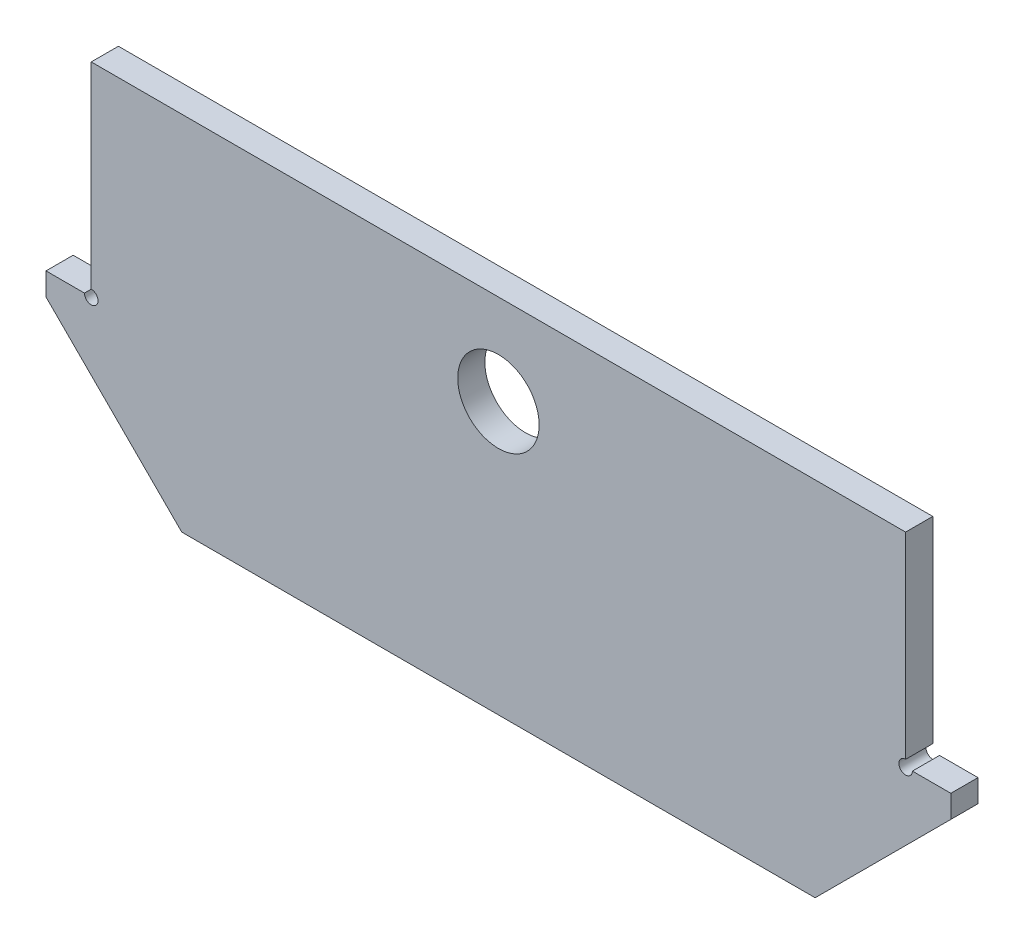
ISO-10303-21;
HEADER;
FILE_DESCRIPTION(('STEP AP214'),'2;1');
FILE_NAME('part.step','',(''),(''),'','','');
FILE_SCHEMA(('AUTOMOTIVE_DESIGN { 1 0 10303 214 1 1 1 1 }'));
ENDSEC;
DATA;
#1=APPLICATION_CONTEXT('core data for automotive mechanical design processes');
#2=APPLICATION_PROTOCOL_DEFINITION('international standard','automotive_design',2000,#1);
#3=PRODUCT_CONTEXT('',#1,'mechanical');
#4=PRODUCT('Part','Part','',(#3));
#5=PRODUCT_RELATED_PRODUCT_CATEGORY('part','',(#4));
#6=PRODUCT_DEFINITION_FORMATION('','',#4);
#7=PRODUCT_DEFINITION_CONTEXT('part definition',#1,'design');
#8=PRODUCT_DEFINITION('design','',#6,#7);
#9=PRODUCT_DEFINITION_SHAPE('','',#8);
#10=(LENGTH_UNIT() NAMED_UNIT(*) SI_UNIT(.MILLI.,.METRE.));
#11=(NAMED_UNIT(*) PLANE_ANGLE_UNIT() SI_UNIT($,.RADIAN.));
#12=(NAMED_UNIT(*) SI_UNIT($,.STERADIAN.) SOLID_ANGLE_UNIT());
#13=UNCERTAINTY_MEASURE_WITH_UNIT(LENGTH_MEASURE(1.E-05),#10,'distance_accuracy_value','');
#14=(GEOMETRIC_REPRESENTATION_CONTEXT(3) GLOBAL_UNCERTAINTY_ASSIGNED_CONTEXT((#13)) GLOBAL_UNIT_ASSIGNED_CONTEXT((#10,
#11,#12)) REPRESENTATION_CONTEXT('',''));
#15=CARTESIAN_POINT('',(0.,0.,0.));
#16=DIRECTION('',(0.,0.,1.));
#17=DIRECTION('',(1.,0.,0.));
#18=AXIS2_PLACEMENT_3D('',#15,#16,#17);
#19=CARTESIAN_POINT('',(0.,0.,-3.));
#20=DIRECTION('',(0.,0.,1.));
#21=DIRECTION('',(1.,0.,0.));
#22=AXIS2_PLACEMENT_3D('',#19,#20,#21);
#23=PLANE('',#22);
#24=DIRECTION('',(1.,0.,0.));
#25=VECTOR('',#24,1.);
#26=CARTESIAN_POINT('',(-99.9999999999998,-1414.,-3.));
#27=LINE('',#26,#25);
#28=CARTESIAN_POINT('',(-91.4999999999998,-1414.,-3.));
#29=VERTEX_POINT('',#28);
#30=CARTESIAN_POINT('',(-99.9999999999998,-1414.,-3.));
#31=VERTEX_POINT('',#30);
#32=EDGE_CURVE('E112',#29,#31,#27,.F.);
#33=ORIENTED_EDGE('',*,*,#32,.F.);
#34=CARTESIAN_POINT('',(-90.,-1414.,-3.));
#35=DIRECTION('',(0.,0.,1.));
#36=DIRECTION('',(1.,0.,0.));
#37=AXIS2_PLACEMENT_3D('',#34,#35,#36);
#38=CIRCLE('',#37,1.49999999999985);
#39=CARTESIAN_POINT('',(-90.,-1412.5,-3.));
#40=VERTEX_POINT('',#39);
#41=EDGE_CURVE('E140',#29,#40,#38,.T.);
#42=ORIENTED_EDGE('',*,*,#41,.T.);
#43=DIRECTION('',(0.,1.,0.));
#44=VECTOR('',#43,1.);
#45=CARTESIAN_POINT('',(-90.,-1414.,-3.));
#46=LINE('',#45,#44);
#47=CARTESIAN_POINT('',(-90.,-1369.,-3.));
#48=VERTEX_POINT('',#47);
#49=EDGE_CURVE('E141',#48,#40,#46,.F.);
#50=ORIENTED_EDGE('',*,*,#49,.F.);
#51=DIRECTION('',(1.,0.,0.));
#52=VECTOR('',#51,1.);
#53=CARTESIAN_POINT('',(-90.,-1369.,-3.));
#54=LINE('',#53,#52);
#55=CARTESIAN_POINT('',(90.0000000000003,-1369.,-3.));
#56=VERTEX_POINT('',#55);
#57=EDGE_CURVE('E145',#56,#48,#54,.F.);
#58=ORIENTED_EDGE('',*,*,#57,.F.);
#59=DIRECTION('',(0.,1.,0.));
#60=VECTOR('',#59,1.);
#61=CARTESIAN_POINT('',(90.0000000000003,-1414.,-3.));
#62=LINE('',#61,#60);
#63=CARTESIAN_POINT('',(90.0000000000003,-1412.5,-3.));
#64=VERTEX_POINT('',#63);
#65=EDGE_CURVE('E157',#64,#56,#62,.T.);
#66=ORIENTED_EDGE('',*,*,#65,.F.);
#67=CARTESIAN_POINT('',(90.0000000000003,-1414.,-3.));
#68=DIRECTION('',(0.,0.,1.));
#69=DIRECTION('',(1.,0.,0.));
#70=AXIS2_PLACEMENT_3D('',#67,#68,#69);
#71=CIRCLE('',#70,1.49999999999985);
#72=CARTESIAN_POINT('',(91.5000000000002,-1414.,-3.));
#73=VERTEX_POINT('',#72);
#74=EDGE_CURVE('E19',#64,#73,#71,.T.);
#75=ORIENTED_EDGE('',*,*,#74,.T.);
#76=DIRECTION('',(1.,0.,0.));
#77=VECTOR('',#76,1.);
#78=CARTESIAN_POINT('',(90.0000000000003,-1414.,-3.));
#79=LINE('',#78,#77);
#80=CARTESIAN_POINT('',(100.,-1414.,-3.));
#81=VERTEX_POINT('',#80);
#82=EDGE_CURVE('E168',#81,#73,#79,.F.);
#83=ORIENTED_EDGE('',*,*,#82,.F.);
#84=DIRECTION('',(0.,1.,0.));
#85=VECTOR('',#84,1.);
#86=CARTESIAN_POINT('',(100.,-1414.,-3.));
#87=LINE('',#86,#85);
#88=CARTESIAN_POINT('',(100.,-1419.,-3.));
#89=VERTEX_POINT('',#88);
#90=EDGE_CURVE('E74',#89,#81,#87,.T.);
#91=ORIENTED_EDGE('',*,*,#90,.F.);
#92=DIRECTION('',(0.707106781186547,0.707106781186548,0.));
#93=VECTOR('',#92,1.);
#94=CARTESIAN_POINT('',(70.0000000000002,-1449.,-3.));
#95=LINE('',#94,#93);
#96=CARTESIAN_POINT('',(70.0000000000002,-1449.,-3.));
#97=VERTEX_POINT('',#96);
#98=EDGE_CURVE('E180',#97,#89,#95,.T.);
#99=ORIENTED_EDGE('',*,*,#98,.F.);
#100=DIRECTION('',(1.,0.,0.));
#101=VECTOR('',#100,1.);
#102=CARTESIAN_POINT('',(-69.9999999999998,-1449.,-3.));
#103=LINE('',#102,#101);
#104=CARTESIAN_POINT('',(-69.9999999999999,-1449.,-3.));
#105=VERTEX_POINT('',#104);
#106=EDGE_CURVE('E191',#105,#97,#103,.T.);
#107=ORIENTED_EDGE('',*,*,#106,.F.);
#108=DIRECTION('',(0.707106781186547,-0.707106781186548,0.));
#109=VECTOR('',#108,1.);
#110=CARTESIAN_POINT('',(-99.9999999999998,-1419.,-3.));
#111=LINE('',#110,#109);
#112=CARTESIAN_POINT('',(-99.9999999999998,-1419.,-3.));
#113=VERTEX_POINT('',#112);
#114=EDGE_CURVE('E201',#113,#105,#111,.T.);
#115=ORIENTED_EDGE('',*,*,#114,.F.);
#116=DIRECTION('',(0.,1.,0.));
#117=VECTOR('',#116,1.);
#118=CARTESIAN_POINT('',(-99.9999999999998,-1414.,-3.));
#119=LINE('',#118,#117);
#120=EDGE_CURVE('E115',#31,#113,#119,.F.);
#121=ORIENTED_EDGE('',*,*,#120,.F.);
#122=EDGE_LOOP('',(#33,#42,#50,#58,#66,#75,#83,#91,#99,#107,#115,#121));
#123=FACE_BOUND('',#122,.T.);
#124=CARTESIAN_POINT('',(7.45777626196619E-13,-1389.,-3.));
#125=DIRECTION('',(0.,0.,1.));
#126=DIRECTION('',(1.,0.,0.));
#127=AXIS2_PLACEMENT_3D('',#124,#125,#126);
#128=CIRCLE('',#127,9.00000000000002);
#129=CARTESIAN_POINT('',(9.00000000000077,-1389.,-3.));
#130=VERTEX_POINT('',#129);
#131=EDGE_CURVE('E130',#130,#130,#128,.T.);
#132=ORIENTED_EDGE('',*,*,#131,.T.);
#133=EDGE_LOOP('',(#132));
#134=FACE_BOUND('',#133,.T.);
#135=ADVANCED_FACE('F16',(#123,#134),#23,.F.);
#136=CARTESIAN_POINT('',(-99.9999999999998,-1414.,-3.));
#137=DIRECTION('',(0.,1.,0.));
#138=DIRECTION('',(0.,0.,1.));
#139=AXIS2_PLACEMENT_3D('',#136,#137,#138);
#140=PLANE('',#139);
#141=DIRECTION('',(0.,0.,1.));
#142=VECTOR('',#141,1.);
#143=CARTESIAN_POINT('',(-99.9999999999998,-1414.,-3.));
#144=LINE('',#143,#142);
#145=CARTESIAN_POINT('',(-99.9999999999998,-1414.,3.));
#146=VERTEX_POINT('',#145);
#147=EDGE_CURVE('E105',#146,#31,#144,.F.);
#148=ORIENTED_EDGE('',*,*,#147,.F.);
#149=DIRECTION('',(1.,0.,0.));
#150=VECTOR('',#149,1.);
#151=CARTESIAN_POINT('',(0.,-1414.,3.));
#152=LINE('',#151,#150);
#153=CARTESIAN_POINT('',(-91.4999999999998,-1414.,3.));
#154=VERTEX_POINT('',#153);
#155=EDGE_CURVE('E110',#154,#146,#152,.F.);
#156=ORIENTED_EDGE('',*,*,#155,.F.);
#157=DIRECTION('',(0.,0.,1.));
#158=VECTOR('',#157,1.);
#159=CARTESIAN_POINT('',(-91.4999999999998,-1414.,-3.));
#160=LINE('',#159,#158);
#161=EDGE_CURVE('E214',#154,#29,#160,.F.);
#162=ORIENTED_EDGE('',*,*,#161,.T.);
#163=ORIENTED_EDGE('',*,*,#32,.T.);
#164=EDGE_LOOP('',(#148,#156,#162,#163));
#165=FACE_BOUND('',#164,.T.);
#166=ADVANCED_FACE('F107',(#165),#140,.T.);
#167=CARTESIAN_POINT('',(-99.9999999999998,-1414.,-3.));
#168=DIRECTION('',(-1.,0.,0.));
#169=DIRECTION('',(0.,0.,1.));
#170=AXIS2_PLACEMENT_3D('',#167,#168,#169);
#171=PLANE('',#170);
#172=ORIENTED_EDGE('',*,*,#147,.T.);
#173=ORIENTED_EDGE('',*,*,#120,.T.);
#174=DIRECTION('',(0.,0.,1.));
#175=VECTOR('',#174,1.);
#176=CARTESIAN_POINT('',(-99.9999999999998,-1419.,-3.));
#177=LINE('',#176,#175);
#178=CARTESIAN_POINT('',(-99.9999999999999,-1419.,3.));
#179=VERTEX_POINT('',#178);
#180=EDGE_CURVE('E121',#179,#113,#177,.F.);
#181=ORIENTED_EDGE('',*,*,#180,.F.);
#182=DIRECTION('',(0.,1.,0.));
#183=VECTOR('',#182,1.);
#184=CARTESIAN_POINT('',(-99.9999999999998,0.,3.));
#185=LINE('',#184,#183);
#186=EDGE_CURVE('E118',#146,#179,#185,.F.);
#187=ORIENTED_EDGE('',*,*,#186,.F.);
#188=EDGE_LOOP('',(#172,#173,#181,#187));
#189=FACE_BOUND('',#188,.T.);
#190=ADVANCED_FACE('F119',(#189),#171,.T.);
#191=CARTESIAN_POINT('',(-99.9999999999998,-1419.,-3.));
#192=DIRECTION('',(-0.707106781186548,-0.707106781186547,0.));
#193=DIRECTION('',(0.707106781186547,-0.707106781186548,0.));
#194=AXIS2_PLACEMENT_3D('',#191,#192,#193);
#195=PLANE('',#194);
#196=ORIENTED_EDGE('',*,*,#180,.T.);
#197=ORIENTED_EDGE('',*,*,#114,.T.);
#198=DIRECTION('',(0.,0.,-1.));
#199=VECTOR('',#198,1.);
#200=CARTESIAN_POINT('',(-69.9999999999998,-1449.,-3.));
#201=LINE('',#200,#199);
#202=CARTESIAN_POINT('',(-69.9999999999998,-1449.,3.));
#203=VERTEX_POINT('',#202);
#204=EDGE_CURVE('E198',#203,#105,#201,.T.);
#205=ORIENTED_EDGE('',*,*,#204,.F.);
#206=DIRECTION('',(0.707106781186555,-0.70710678118654,0.));
#207=VECTOR('',#206,1.);
#208=CARTESIAN_POINT('',(-99.9999999999998,-1419.,3.));
#209=LINE('',#208,#207);
#210=EDGE_CURVE('E125',#179,#203,#209,.T.);
#211=ORIENTED_EDGE('',*,*,#210,.F.);
#212=EDGE_LOOP('',(#196,#197,#205,#211));
#213=FACE_BOUND('',#212,.T.);
#214=ADVANCED_FACE('F386',(#213),#195,.T.);
#215=CARTESIAN_POINT('',(-69.9999999999998,-1449.,-3.));
#216=DIRECTION('',(0.,-1.,0.));
#217=DIRECTION('',(0.,0.,-1.));
#218=AXIS2_PLACEMENT_3D('',#215,#216,#217);
#219=PLANE('',#218);
#220=ORIENTED_EDGE('',*,*,#204,.T.);
#221=ORIENTED_EDGE('',*,*,#106,.T.);
#222=DIRECTION('',(0.,0.,1.));
#223=VECTOR('',#222,1.);
#224=CARTESIAN_POINT('',(70.0000000000002,-1449.,-3.));
#225=LINE('',#224,#223);
#226=CARTESIAN_POINT('',(70.0000000000002,-1449.,3.));
#227=VERTEX_POINT('',#226);
#228=EDGE_CURVE('E188',#227,#97,#225,.F.);
#229=ORIENTED_EDGE('',*,*,#228,.F.);
#230=DIRECTION('',(1.,0.,0.));
#231=VECTOR('',#230,1.);
#232=CARTESIAN_POINT('',(0.,-1449.,3.));
#233=LINE('',#232,#231);
#234=EDGE_CURVE('E185',#203,#227,#233,.T.);
#235=ORIENTED_EDGE('',*,*,#234,.F.);
#236=EDGE_LOOP('',(#220,#221,#229,#235));
#237=FACE_BOUND('',#236,.T.);
#238=ADVANCED_FACE('F378',(#237),#219,.T.);
#239=CARTESIAN_POINT('',(70.0000000000002,-1449.,-3.));
#240=DIRECTION('',(0.707106781186548,-0.707106781186547,0.));
#241=DIRECTION('',(0.707106781186547,0.707106781186548,0.));
#242=AXIS2_PLACEMENT_3D('',#239,#240,#241);
#243=PLANE('',#242);
#244=ORIENTED_EDGE('',*,*,#228,.T.);
#245=ORIENTED_EDGE('',*,*,#98,.T.);
#246=DIRECTION('',(0.,0.,-1.));
#247=VECTOR('',#246,1.);
#248=CARTESIAN_POINT('',(100.,-1419.,-3.));
#249=LINE('',#248,#247);
#250=CARTESIAN_POINT('',(100.,-1419.,3.));
#251=VERTEX_POINT('',#250);
#252=EDGE_CURVE('E178',#251,#89,#249,.T.);
#253=ORIENTED_EDGE('',*,*,#252,.F.);
#254=DIRECTION('',(0.707106781186555,0.70710678118654,0.));
#255=VECTOR('',#254,1.);
#256=CARTESIAN_POINT('',(70.0000000000002,-1449.,3.));
#257=LINE('',#256,#255);
#258=EDGE_CURVE('E175',#227,#251,#257,.T.);
#259=ORIENTED_EDGE('',*,*,#258,.F.);
#260=EDGE_LOOP('',(#244,#245,#253,#259));
#261=FACE_BOUND('',#260,.T.);
#262=ADVANCED_FACE('F280',(#261),#243,.T.);
#263=CARTESIAN_POINT('',(100.,-1414.,-3.));
#264=DIRECTION('',(1.,0.,0.));
#265=DIRECTION('',(0.,0.,-1.));
#266=AXIS2_PLACEMENT_3D('',#263,#264,#265);
#267=PLANE('',#266);
#268=ORIENTED_EDGE('',*,*,#252,.T.);
#269=ORIENTED_EDGE('',*,*,#90,.T.);
#270=DIRECTION('',(0.,0.,1.));
#271=VECTOR('',#270,1.);
#272=CARTESIAN_POINT('',(100.,-1414.,-3.));
#273=LINE('',#272,#271);
#274=CARTESIAN_POINT('',(100.,-1414.,3.));
#275=VERTEX_POINT('',#274);
#276=EDGE_CURVE('E165',#275,#81,#273,.F.);
#277=ORIENTED_EDGE('',*,*,#276,.F.);
#278=DIRECTION('',(0.,1.,0.));
#279=VECTOR('',#278,1.);
#280=CARTESIAN_POINT('',(100.,0.,3.));
#281=LINE('',#280,#279);
#282=EDGE_CURVE('E171',#251,#275,#281,.T.);
#283=ORIENTED_EDGE('',*,*,#282,.F.);
#284=EDGE_LOOP('',(#268,#269,#277,#283));
#285=FACE_BOUND('',#284,.T.);
#286=ADVANCED_FACE('F276',(#285),#267,.T.);
#287=CARTESIAN_POINT('',(90.0000000000003,-1414.,-3.));
#288=DIRECTION('',(0.,1.,0.));
#289=DIRECTION('',(0.,0.,1.));
#290=AXIS2_PLACEMENT_3D('',#287,#288,#289);
#291=PLANE('',#290);
#292=ORIENTED_EDGE('',*,*,#276,.T.);
#293=ORIENTED_EDGE('',*,*,#82,.T.);
#294=DIRECTION('',(0.,0.,1.));
#295=VECTOR('',#294,1.);
#296=CARTESIAN_POINT('',(91.5000000000002,-1414.,-3.));
#297=LINE('',#296,#295);
#298=CARTESIAN_POINT('',(91.5000000000002,-1414.,3.));
#299=VERTEX_POINT('',#298);
#300=EDGE_CURVE('E163',#73,#299,#297,.T.);
#301=ORIENTED_EDGE('',*,*,#300,.T.);
#302=DIRECTION('',(1.,0.,0.));
#303=VECTOR('',#302,1.);
#304=CARTESIAN_POINT('',(0.,-1414.,3.));
#305=LINE('',#304,#303);
#306=EDGE_CURVE('E174',#275,#299,#305,.F.);
#307=ORIENTED_EDGE('',*,*,#306,.F.);
#308=EDGE_LOOP('',(#292,#293,#301,#307));
#309=FACE_BOUND('',#308,.T.);
#310=ADVANCED_FACE('F274',(#309),#291,.T.);
#311=CARTESIAN_POINT('',(90.0000000000003,-1414.,-3.));
#312=DIRECTION('',(0.,0.,1.));
#313=DIRECTION('',(1.,0.,0.));
#314=AXIS2_PLACEMENT_3D('',#311,#312,#313);
#315=CYLINDRICAL_SURFACE('',#314,1.49999999999985);
#316=CARTESIAN_POINT('',(90.0000000000003,-1414.,3.));
#317=DIRECTION('',(0.,0.,1.));
#318=DIRECTION('',(1.,0.,0.));
#319=AXIS2_PLACEMENT_3D('',#316,#317,#318);
#320=CIRCLE('',#319,1.49999999999985);
#321=CARTESIAN_POINT('',(90.0000000000003,-1412.5,3.));
#322=VERTEX_POINT('',#321);
#323=EDGE_CURVE('E248',#299,#322,#320,.F.);
#324=ORIENTED_EDGE('',*,*,#323,.F.);
#325=ORIENTED_EDGE('',*,*,#300,.F.);
#326=ORIENTED_EDGE('',*,*,#74,.F.);
#327=DIRECTION('',(0.,0.,-1.));
#328=VECTOR('',#327,1.);
#329=CARTESIAN_POINT('',(90.0000000000003,-1412.5,-3.));
#330=LINE('',#329,#328);
#331=EDGE_CURVE('E160',#322,#64,#330,.T.);
#332=ORIENTED_EDGE('',*,*,#331,.F.);
#333=EDGE_LOOP('',(#324,#325,#326,#332));
#334=FACE_BOUND('',#333,.T.);
#335=ADVANCED_FACE('F284',(#334),#315,.F.);
#336=CARTESIAN_POINT('',(90.0000000000003,-1414.,-3.));
#337=DIRECTION('',(1.,0.,0.));
#338=DIRECTION('',(0.,0.,-1.));
#339=AXIS2_PLACEMENT_3D('',#336,#337,#338);
#340=PLANE('',#339);
#341=DIRECTION('',(0.,0.,1.));
#342=VECTOR('',#341,1.);
#343=CARTESIAN_POINT('',(90.0000000000003,-1369.,-3.));
#344=LINE('',#343,#342);
#345=CARTESIAN_POINT('',(90.0000000000003,-1369.,3.));
#346=VERTEX_POINT('',#345);
#347=EDGE_CURVE('E154',#346,#56,#344,.F.);
#348=ORIENTED_EDGE('',*,*,#347,.F.);
#349=DIRECTION('',(0.,1.,0.));
#350=VECTOR('',#349,1.);
#351=CARTESIAN_POINT('',(90.0000000000003,0.,3.));
#352=LINE('',#351,#350);
#353=EDGE_CURVE('E151',#322,#346,#352,.T.);
#354=ORIENTED_EDGE('',*,*,#353,.F.);
#355=ORIENTED_EDGE('',*,*,#331,.T.);
#356=ORIENTED_EDGE('',*,*,#65,.T.);
#357=EDGE_LOOP('',(#348,#354,#355,#356));
#358=FACE_BOUND('',#357,.T.);
#359=ADVANCED_FACE('F288',(#358),#340,.T.);
#360=CARTESIAN_POINT('',(-90.,-1369.,-3.));
#361=DIRECTION('',(0.,1.,0.));
#362=DIRECTION('',(0.,0.,1.));
#363=AXIS2_PLACEMENT_3D('',#360,#361,#362);
#364=PLANE('',#363);
#365=ORIENTED_EDGE('',*,*,#347,.T.);
#366=ORIENTED_EDGE('',*,*,#57,.T.);
#367=DIRECTION('',(0.,0.,1.));
#368=VECTOR('',#367,1.);
#369=CARTESIAN_POINT('',(-90.,-1369.,-3.));
#370=LINE('',#369,#368);
#371=CARTESIAN_POINT('',(-90.,-1369.,3.));
#372=VERTEX_POINT('',#371);
#373=EDGE_CURVE('E142',#372,#48,#370,.F.);
#374=ORIENTED_EDGE('',*,*,#373,.F.);
#375=DIRECTION('',(1.,0.,0.));
#376=VECTOR('',#375,1.);
#377=CARTESIAN_POINT('',(0.,-1369.,3.));
#378=LINE('',#377,#376);
#379=EDGE_CURVE('E148',#346,#372,#378,.F.);
#380=ORIENTED_EDGE('',*,*,#379,.F.);
#381=EDGE_LOOP('',(#365,#366,#374,#380));
#382=FACE_BOUND('',#381,.T.);
#383=ADVANCED_FACE('F292',(#382),#364,.T.);
#384=CARTESIAN_POINT('',(-90.,-1414.,-3.));
#385=DIRECTION('',(-1.,0.,0.));
#386=DIRECTION('',(0.,0.,1.));
#387=AXIS2_PLACEMENT_3D('',#384,#385,#386);
#388=PLANE('',#387);
#389=ORIENTED_EDGE('',*,*,#373,.T.);
#390=ORIENTED_EDGE('',*,*,#49,.T.);
#391=DIRECTION('',(0.,0.,1.));
#392=VECTOR('',#391,1.);
#393=CARTESIAN_POINT('',(-90.,-1412.5,-3.));
#394=LINE('',#393,#392);
#395=CARTESIAN_POINT('',(-90.,-1412.5,3.));
#396=VERTEX_POINT('',#395);
#397=EDGE_CURVE('E138',#40,#396,#394,.T.);
#398=ORIENTED_EDGE('',*,*,#397,.T.);
#399=DIRECTION('',(0.,1.,0.));
#400=VECTOR('',#399,1.);
#401=CARTESIAN_POINT('',(-90.,0.,3.));
#402=LINE('',#401,#400);
#403=EDGE_CURVE('E25',#372,#396,#402,.F.);
#404=ORIENTED_EDGE('',*,*,#403,.F.);
#405=EDGE_LOOP('',(#389,#390,#398,#404));
#406=FACE_BOUND('',#405,.T.);
#407=ADVANCED_FACE('F260',(#406),#388,.T.);
#408=CARTESIAN_POINT('',(-90.,-1414.,-3.));
#409=DIRECTION('',(0.,0.,1.));
#410=DIRECTION('',(1.,0.,0.));
#411=AXIS2_PLACEMENT_3D('',#408,#409,#410);
#412=CYLINDRICAL_SURFACE('',#411,1.49999999999985);
#413=ORIENTED_EDGE('',*,*,#41,.F.);
#414=ORIENTED_EDGE('',*,*,#161,.F.);
#415=CARTESIAN_POINT('',(-90.,-1414.,3.));
#416=DIRECTION('',(0.,0.,1.));
#417=DIRECTION('',(1.,0.,0.));
#418=AXIS2_PLACEMENT_3D('',#415,#416,#417);
#419=CIRCLE('',#418,1.49999999999985);
#420=EDGE_CURVE('E34',#396,#154,#419,.F.);
#421=ORIENTED_EDGE('',*,*,#420,.F.);
#422=ORIENTED_EDGE('',*,*,#397,.F.);
#423=EDGE_LOOP('',(#413,#414,#421,#422));
#424=FACE_BOUND('',#423,.T.);
#425=ADVANCED_FACE('F257',(#424),#412,.F.);
#426=CARTESIAN_POINT('',(7.45777626196619E-13,-1389.,-3.));
#427=DIRECTION('',(0.,0.,1.));
#428=DIRECTION('',(1.,0.,0.));
#429=AXIS2_PLACEMENT_3D('',#426,#427,#428);
#430=CYLINDRICAL_SURFACE('',#429,9.00000000000002);
#431=CARTESIAN_POINT('',(7.45777626196619E-13,-1389.,3.));
#432=DIRECTION('',(0.,0.,1.));
#433=DIRECTION('',(1.,0.,0.));
#434=AXIS2_PLACEMENT_3D('',#431,#432,#433);
#435=CIRCLE('',#434,9.00000000000002);
#436=CARTESIAN_POINT('',(9.00000000000077,-1389.,3.));
#437=VERTEX_POINT('',#436);
#438=EDGE_CURVE('E11',#437,#437,#435,.F.);
#439=ORIENTED_EDGE('',*,*,#438,.F.);
#440=EDGE_LOOP('',(#439));
#441=FACE_BOUND('',#440,.T.);
#442=ORIENTED_EDGE('',*,*,#131,.F.);
#443=EDGE_LOOP('',(#442));
#444=FACE_BOUND('',#443,.T.);
#445=ADVANCED_FACE('F303',(#441,#444),#430,.F.);
#446=CARTESIAN_POINT('',(0.,0.,3.));
#447=DIRECTION('',(0.,0.,1.));
#448=DIRECTION('',(1.,0.,0.));
#449=AXIS2_PLACEMENT_3D('',#446,#447,#448);
#450=PLANE('',#449);
#451=ORIENTED_EDGE('',*,*,#438,.T.);
#452=EDGE_LOOP('',(#451));
#453=FACE_BOUND('',#452,.T.);
#454=ORIENTED_EDGE('',*,*,#403,.T.);
#455=ORIENTED_EDGE('',*,*,#420,.T.);
#456=ORIENTED_EDGE('',*,*,#155,.T.);
#457=ORIENTED_EDGE('',*,*,#186,.T.);
#458=ORIENTED_EDGE('',*,*,#210,.T.);
#459=ORIENTED_EDGE('',*,*,#234,.T.);
#460=ORIENTED_EDGE('',*,*,#258,.T.);
#461=ORIENTED_EDGE('',*,*,#282,.T.);
#462=ORIENTED_EDGE('',*,*,#306,.T.);
#463=ORIENTED_EDGE('',*,*,#323,.T.);
#464=ORIENTED_EDGE('',*,*,#353,.T.);
#465=ORIENTED_EDGE('',*,*,#379,.T.);
#466=EDGE_LOOP('',(#454,#455,#456,#457,#458,#459,#460,#461,#462,#463,#464,#465));
#467=FACE_BOUND('',#466,.T.);
#468=ADVANCED_FACE('F128',(#453,#467),#450,.T.);
#469=CLOSED_SHELL('',(#135,#166,#190,#214,#238,#262,#286,#310,#335,#359,#383,#407,#425,#445,#468));
#470=MANIFOLD_SOLID_BREP('B1',#469);
#471=ADVANCED_BREP_SHAPE_REPRESENTATION('',(#18,#470),#14);
#472=SHAPE_DEFINITION_REPRESENTATION(#9,#471);
ENDSEC;
END-ISO-10303-21;
